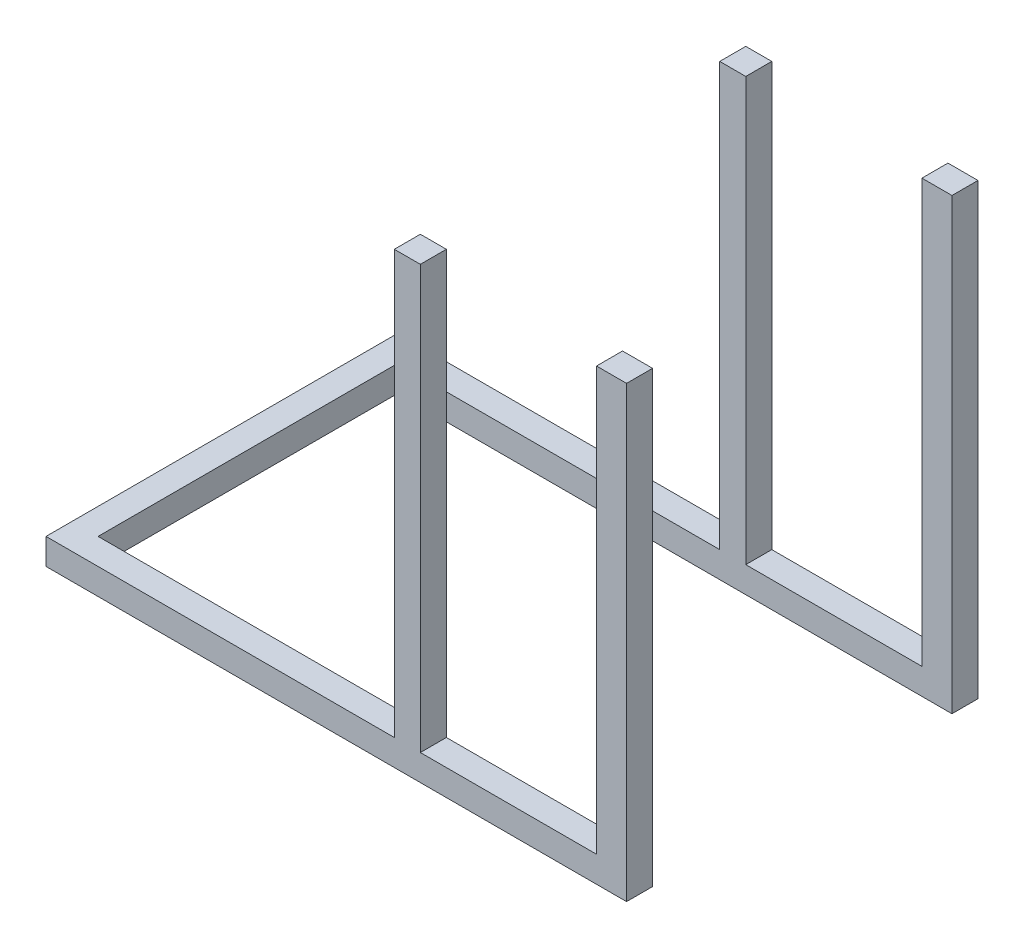
ISO-10303-21;
HEADER;
FILE_DESCRIPTION(('STEP AP214'),'2;1');
FILE_NAME('part.step','',(''),(''),'','','');
FILE_SCHEMA(('AUTOMOTIVE_DESIGN { 1 0 10303 214 1 1 1 1 }'));
ENDSEC;
DATA;
#1=APPLICATION_CONTEXT('core data for automotive mechanical design processes');
#2=APPLICATION_PROTOCOL_DEFINITION('international standard','automotive_design',2000,#1);
#3=PRODUCT_CONTEXT('',#1,'mechanical');
#4=PRODUCT('Part','Part','',(#3));
#5=PRODUCT_RELATED_PRODUCT_CATEGORY('part','',(#4));
#6=PRODUCT_DEFINITION_FORMATION('','',#4);
#7=PRODUCT_DEFINITION_CONTEXT('part definition',#1,'design');
#8=PRODUCT_DEFINITION('design','',#6,#7);
#9=PRODUCT_DEFINITION_SHAPE('','',#8);
#10=(LENGTH_UNIT() NAMED_UNIT(*) SI_UNIT(.MILLI.,.METRE.));
#11=(NAMED_UNIT(*) PLANE_ANGLE_UNIT() SI_UNIT($,.RADIAN.));
#12=(NAMED_UNIT(*) SI_UNIT($,.STERADIAN.) SOLID_ANGLE_UNIT());
#13=UNCERTAINTY_MEASURE_WITH_UNIT(LENGTH_MEASURE(1.E-05),#10,'distance_accuracy_value','');
#14=(GEOMETRIC_REPRESENTATION_CONTEXT(3) GLOBAL_UNCERTAINTY_ASSIGNED_CONTEXT((#13)) GLOBAL_UNIT_ASSIGNED_CONTEXT((#10,
#11,#12)) REPRESENTATION_CONTEXT('',''));
#15=CARTESIAN_POINT('',(0.,0.,0.));
#16=DIRECTION('',(0.,0.,1.));
#17=DIRECTION('',(1.,0.,0.));
#18=AXIS2_PLACEMENT_3D('',#15,#16,#17);
#19=CARTESIAN_POINT('',(0.,58.,0.));
#20=DIRECTION('',(0.,1.,0.));
#21=DIRECTION('',(0.,0.,1.));
#22=AXIS2_PLACEMENT_3D('',#19,#20,#21);
#23=PLANE('',#22);
#24=DIRECTION('',(1.,0.,0.));
#25=VECTOR('',#24,1.);
#26=CARTESIAN_POINT('',(-435.,58.,391.5));
#27=LINE('',#26,#25);
#28=CARTESIAN_POINT('',(-435.,58.,391.5));
#29=VERTEX_POINT('',#28);
#30=CARTESIAN_POINT('',(341.,58.,391.5));
#31=VERTEX_POINT('',#30);
#32=EDGE_CURVE('E56',#29,#31,#27,.T.);
#33=ORIENTED_EDGE('',*,*,#32,.T.);
#34=DIRECTION('',(0.,0.,-1.));
#35=VECTOR('',#34,1.);
#36=CARTESIAN_POINT('',(341.,58.,0.));
#37=LINE('',#36,#35);
#38=CARTESIAN_POINT('',(341.,58.,333.5));
#39=VERTEX_POINT('',#38);
#40=EDGE_CURVE('E192',#31,#39,#37,.T.);
#41=ORIENTED_EDGE('',*,*,#40,.T.);
#42=DIRECTION('',(-1.,0.,0.));
#43=VECTOR('',#42,1.);
#44=CARTESIAN_POINT('',(-377.,58.,333.5));
#45=LINE('',#44,#43);
#46=CARTESIAN_POINT('',(-377.,58.,333.5));
#47=VERTEX_POINT('',#46);
#48=EDGE_CURVE('E268',#39,#47,#45,.T.);
#49=ORIENTED_EDGE('',*,*,#48,.T.);
#50=DIRECTION('',(0.,0.,-1.));
#51=VECTOR('',#50,1.);
#52=CARTESIAN_POINT('',(-377.,58.,-333.5));
#53=LINE('',#52,#51);
#54=CARTESIAN_POINT('',(-377.,58.,-333.5));
#55=VERTEX_POINT('',#54);
#56=EDGE_CURVE('E271',#47,#55,#53,.T.);
#57=ORIENTED_EDGE('',*,*,#56,.T.);
#58=DIRECTION('',(1.,0.,0.));
#59=VECTOR('',#58,1.);
#60=CARTESIAN_POINT('',(-377.,58.,-333.5));
#61=LINE('',#60,#59);
#62=CARTESIAN_POINT('',(341.,58.,-333.5));
#63=VERTEX_POINT('',#62);
#64=EDGE_CURVE('E274',#55,#63,#61,.T.);
#65=ORIENTED_EDGE('',*,*,#64,.T.);
#66=DIRECTION('',(0.,0.,-1.));
#67=VECTOR('',#66,1.);
#68=CARTESIAN_POINT('',(341.,58.,0.));
#69=LINE('',#68,#67);
#70=CARTESIAN_POINT('',(341.,58.,-391.5));
#71=VERTEX_POINT('',#70);
#72=EDGE_CURVE('E257',#63,#71,#69,.T.);
#73=ORIENTED_EDGE('',*,*,#72,.T.);
#74=DIRECTION('',(-1.,0.,0.));
#75=VECTOR('',#74,1.);
#76=CARTESIAN_POINT('',(-435.,58.,-391.5));
#77=LINE('',#76,#75);
#78=CARTESIAN_POINT('',(-435.,58.,-391.5));
#79=VERTEX_POINT('',#78);
#80=EDGE_CURVE('E276',#71,#79,#77,.T.);
#81=ORIENTED_EDGE('',*,*,#80,.T.);
#82=DIRECTION('',(0.,0.,1.));
#83=VECTOR('',#82,1.);
#84=CARTESIAN_POINT('',(-435.,58.,-391.5));
#85=LINE('',#84,#83);
#86=EDGE_CURVE('E263',#79,#29,#85,.T.);
#87=ORIENTED_EDGE('',*,*,#86,.T.);
#88=EDGE_LOOP('',(#33,#41,#49,#57,#65,#73,#81,#87));
#89=FACE_BOUND('',#88,.T.);
#90=ADVANCED_FACE('F33',(#89),#23,.T.);
#91=CARTESIAN_POINT('',(791.45225187829,58.,333.5));
#92=VERTEX_POINT('',#91);
#93=CARTESIAN_POINT('',(399.,58.,333.5));
#94=VERTEX_POINT('',#93);
#95=EDGE_CURVE('E269',#92,#94,#45,.T.);
#96=ORIENTED_EDGE('',*,*,#95,.T.);
#97=DIRECTION('',(0.,0.,1.));
#98=VECTOR('',#97,1.);
#99=CARTESIAN_POINT('',(399.,58.,0.));
#100=LINE('',#99,#98);
#101=CARTESIAN_POINT('',(399.,58.,391.5));
#102=VERTEX_POINT('',#101);
#103=EDGE_CURVE('E48',#94,#102,#100,.T.);
#104=ORIENTED_EDGE('',*,*,#103,.T.);
#105=CARTESIAN_POINT('',(791.45225187829,58.,391.5));
#106=VERTEX_POINT('',#105);
#107=EDGE_CURVE('E265',#102,#106,#27,.T.);
#108=ORIENTED_EDGE('',*,*,#107,.T.);
#109=DIRECTION('',(0.,0.,-1.));
#110=VECTOR('',#109,1.);
#111=CARTESIAN_POINT('',(791.45225187829,58.,0.));
#112=LINE('',#111,#110);
#113=EDGE_CURVE('E216',#106,#92,#112,.T.);
#114=ORIENTED_EDGE('',*,*,#113,.T.);
#115=EDGE_LOOP('',(#96,#104,#108,#114));
#116=FACE_BOUND('',#115,.T.);
#117=ADVANCED_FACE('F350',(#116),#23,.T.);
#118=CARTESIAN_POINT('',(399.,58.,-333.5));
#119=VERTEX_POINT('',#118);
#120=CARTESIAN_POINT('',(791.45225187829,58.,-333.5));
#121=VERTEX_POINT('',#120);
#122=EDGE_CURVE('E273',#119,#121,#61,.T.);
#123=ORIENTED_EDGE('',*,*,#122,.T.);
#124=DIRECTION('',(0.,0.,-1.));
#125=VECTOR('',#124,1.);
#126=CARTESIAN_POINT('',(791.45225187829,58.,0.));
#127=LINE('',#126,#125);
#128=CARTESIAN_POINT('',(791.45225187829,58.,-391.5));
#129=VERTEX_POINT('',#128);
#130=EDGE_CURVE('E234',#121,#129,#127,.T.);
#131=ORIENTED_EDGE('',*,*,#130,.T.);
#132=CARTESIAN_POINT('',(399.,58.,-391.5));
#133=VERTEX_POINT('',#132);
#134=EDGE_CURVE('E277',#129,#133,#77,.T.);
#135=ORIENTED_EDGE('',*,*,#134,.T.);
#136=DIRECTION('',(0.,0.,1.));
#137=VECTOR('',#136,1.);
#138=CARTESIAN_POINT('',(399.,58.,3.8187843691848E-13));
#139=LINE('',#138,#137);
#140=EDGE_CURVE('E259',#133,#119,#139,.T.);
#141=ORIENTED_EDGE('',*,*,#140,.T.);
#142=EDGE_LOOP('',(#123,#131,#135,#141));
#143=FACE_BOUND('',#142,.T.);
#144=ADVANCED_FACE('F352',(#143),#23,.T.);
#145=CARTESIAN_POINT('',(-435.,58.,-391.5));
#146=DIRECTION('',(1.,0.,0.));
#147=DIRECTION('',(0.,0.,-1.));
#148=AXIS2_PLACEMENT_3D('',#145,#146,#147);
#149=PLANE('',#148);
#150=DIRECTION('',(0.,0.,1.));
#151=VECTOR('',#150,1.);
#152=CARTESIAN_POINT('',(-435.,0.,-391.5));
#153=LINE('',#152,#151);
#154=CARTESIAN_POINT('',(-435.,0.,-391.5));
#155=VERTEX_POINT('',#154);
#156=CARTESIAN_POINT('',(-435.,0.,391.5));
#157=VERTEX_POINT('',#156);
#158=EDGE_CURVE('E262',#155,#157,#153,.T.);
#159=ORIENTED_EDGE('',*,*,#158,.T.);
#160=DIRECTION('',(0.,-1.,0.));
#161=VECTOR('',#160,1.);
#162=CARTESIAN_POINT('',(-435.,58.,391.5));
#163=LINE('',#162,#161);
#164=EDGE_CURVE('E11',#29,#157,#163,.T.);
#165=ORIENTED_EDGE('',*,*,#164,.F.);
#166=ORIENTED_EDGE('',*,*,#86,.F.);
#167=DIRECTION('',(0.,-1.,0.));
#168=VECTOR('',#167,1.);
#169=CARTESIAN_POINT('',(-435.,58.,-391.5));
#170=LINE('',#169,#168);
#171=EDGE_CURVE('E279',#79,#155,#170,.T.);
#172=ORIENTED_EDGE('',*,*,#171,.T.);
#173=EDGE_LOOP('',(#159,#165,#166,#172));
#174=FACE_BOUND('',#173,.T.);
#175=ADVANCED_FACE('F35',(#174),#149,.F.);
#176=CARTESIAN_POINT('',(-435.,58.,391.5));
#177=DIRECTION('',(0.,0.,-1.));
#178=DIRECTION('',(-1.,0.,0.));
#179=AXIS2_PLACEMENT_3D('',#176,#177,#178);
#180=PLANE('',#179);
#181=ORIENTED_EDGE('',*,*,#107,.F.);
#182=DIRECTION('',(0.,-1.,0.));
#183=VECTOR('',#182,1.);
#184=CARTESIAN_POINT('',(399.,1000.,391.5));
#185=LINE('',#184,#183);
#186=CARTESIAN_POINT('',(399.,1000.,391.5));
#187=VERTEX_POINT('',#186);
#188=EDGE_CURVE('E177',#187,#102,#185,.T.);
#189=ORIENTED_EDGE('',*,*,#188,.F.);
#190=DIRECTION('',(1.,0.,0.));
#191=VECTOR('',#190,1.);
#192=CARTESIAN_POINT('',(341.,1000.,391.5));
#193=LINE('',#192,#191);
#194=CARTESIAN_POINT('',(341.,1000.,391.5));
#195=VERTEX_POINT('',#194);
#196=EDGE_CURVE('E171',#195,#187,#193,.T.);
#197=ORIENTED_EDGE('',*,*,#196,.F.);
#198=DIRECTION('',(0.,-1.,0.));
#199=VECTOR('',#198,1.);
#200=CARTESIAN_POINT('',(341.,1000.,391.5));
#201=LINE('',#200,#199);
#202=EDGE_CURVE('E175',#195,#31,#201,.T.);
#203=ORIENTED_EDGE('',*,*,#202,.T.);
#204=ORIENTED_EDGE('',*,*,#32,.F.);
#205=ORIENTED_EDGE('',*,*,#164,.T.);
#206=DIRECTION('',(1.,0.,0.));
#207=VECTOR('',#206,1.);
#208=CARTESIAN_POINT('',(-435.,0.,391.5));
#209=LINE('',#208,#207);
#210=CARTESIAN_POINT('',(858.400000000001,0.,391.5));
#211=VERTEX_POINT('',#210);
#212=EDGE_CURVE('E282',#157,#211,#209,.T.);
#213=ORIENTED_EDGE('',*,*,#212,.T.);
#214=DIRECTION('',(0.,-1.,0.));
#215=VECTOR('',#214,1.);
#216=CARTESIAN_POINT('',(858.400000000001,58.,391.5));
#217=LINE('',#216,#215);
#218=CARTESIAN_POINT('',(858.4,1000.,391.5));
#219=VERTEX_POINT('',#218);
#220=EDGE_CURVE('E41',#219,#211,#217,.T.);
#221=ORIENTED_EDGE('',*,*,#220,.F.);
#222=DIRECTION('',(1.,0.,0.));
#223=VECTOR('',#222,1.);
#224=CARTESIAN_POINT('',(858.4,1000.,391.5));
#225=LINE('',#224,#223);
#226=CARTESIAN_POINT('',(791.45225187829,1000.,391.5));
#227=VERTEX_POINT('',#226);
#228=EDGE_CURVE('E207',#227,#219,#225,.T.);
#229=ORIENTED_EDGE('',*,*,#228,.F.);
#230=DIRECTION('',(0.,-1.,0.));
#231=VECTOR('',#230,1.);
#232=CARTESIAN_POINT('',(791.45225187829,1000.,391.5));
#233=LINE('',#232,#231);
#234=EDGE_CURVE('E210',#227,#106,#233,.T.);
#235=ORIENTED_EDGE('',*,*,#234,.T.);
#236=EDGE_LOOP('',(#181,#189,#197,#203,#204,#205,#213,#221,#229,#235));
#237=FACE_BOUND('',#236,.T.);
#238=ADVANCED_FACE('F173',(#237),#180,.F.);
#239=CARTESIAN_POINT('',(858.4,58.,333.5));
#240=DIRECTION('',(-1.,0.,0.));
#241=DIRECTION('',(0.,0.,1.));
#242=AXIS2_PLACEMENT_3D('',#239,#240,#241);
#243=PLANE('',#242);
#244=DIRECTION('',(0.,0.,-1.));
#245=VECTOR('',#244,1.);
#246=CARTESIAN_POINT('',(858.4,0.,333.5));
#247=LINE('',#246,#245);
#248=CARTESIAN_POINT('',(858.4,0.,333.5));
#249=VERTEX_POINT('',#248);
#250=EDGE_CURVE('E284',#211,#249,#247,.T.);
#251=ORIENTED_EDGE('',*,*,#250,.T.);
#252=DIRECTION('',(0.,-1.,0.));
#253=VECTOR('',#252,1.);
#254=CARTESIAN_POINT('',(858.4,58.,333.5));
#255=LINE('',#254,#253);
#256=CARTESIAN_POINT('',(858.4,1000.,333.5));
#257=VERTEX_POINT('',#256);
#258=EDGE_CURVE('E309',#257,#249,#255,.T.);
#259=ORIENTED_EDGE('',*,*,#258,.F.);
#260=DIRECTION('',(0.,0.,-1.));
#261=VECTOR('',#260,1.);
#262=CARTESIAN_POINT('',(858.4,1000.,333.5));
#263=LINE('',#262,#261);
#264=EDGE_CURVE('E200',#219,#257,#263,.T.);
#265=ORIENTED_EDGE('',*,*,#264,.F.);
#266=ORIENTED_EDGE('',*,*,#220,.T.);
#267=EDGE_LOOP('',(#251,#259,#265,#266));
#268=FACE_BOUND('',#267,.T.);
#269=ADVANCED_FACE('F315',(#268),#243,.F.);
#270=CARTESIAN_POINT('',(-377.,58.,333.5));
#271=DIRECTION('',(0.,0.,1.));
#272=DIRECTION('',(1.,0.,0.));
#273=AXIS2_PLACEMENT_3D('',#270,#271,#272);
#274=PLANE('',#273);
#275=DIRECTION('',(-1.,0.,0.));
#276=VECTOR('',#275,1.);
#277=CARTESIAN_POINT('',(-377.,0.,333.5));
#278=LINE('',#277,#276);
#279=CARTESIAN_POINT('',(-377.,0.,333.5));
#280=VERTEX_POINT('',#279);
#281=EDGE_CURVE('E286',#249,#280,#278,.T.);
#282=ORIENTED_EDGE('',*,*,#281,.T.);
#283=DIRECTION('',(0.,-1.,0.));
#284=VECTOR('',#283,1.);
#285=CARTESIAN_POINT('',(-377.,58.,333.5));
#286=LINE('',#285,#284);
#287=EDGE_CURVE('E306',#47,#280,#286,.T.);
#288=ORIENTED_EDGE('',*,*,#287,.F.);
#289=ORIENTED_EDGE('',*,*,#48,.F.);
#290=DIRECTION('',(0.,-1.,0.));
#291=VECTOR('',#290,1.);
#292=CARTESIAN_POINT('',(341.,1000.,333.5));
#293=LINE('',#292,#291);
#294=CARTESIAN_POINT('',(341.,1000.,333.5));
#295=VERTEX_POINT('',#294);
#296=EDGE_CURVE('E333',#295,#39,#293,.T.);
#297=ORIENTED_EDGE('',*,*,#296,.F.);
#298=DIRECTION('',(-1.,0.,0.));
#299=VECTOR('',#298,1.);
#300=CARTESIAN_POINT('',(341.,1000.,333.5));
#301=LINE('',#300,#299);
#302=CARTESIAN_POINT('',(399.,1000.,333.5));
#303=VERTEX_POINT('',#302);
#304=EDGE_CURVE('E186',#303,#295,#301,.T.);
#305=ORIENTED_EDGE('',*,*,#304,.F.);
#306=DIRECTION('',(0.,-1.,0.));
#307=VECTOR('',#306,1.);
#308=CARTESIAN_POINT('',(399.,1000.,333.5));
#309=LINE('',#308,#307);
#310=EDGE_CURVE('E195',#303,#94,#309,.T.);
#311=ORIENTED_EDGE('',*,*,#310,.T.);
#312=ORIENTED_EDGE('',*,*,#95,.F.);
#313=DIRECTION('',(0.,-1.,0.));
#314=VECTOR('',#313,1.);
#315=CARTESIAN_POINT('',(791.45225187829,1000.,333.5));
#316=LINE('',#315,#314);
#317=CARTESIAN_POINT('',(791.45225187829,1000.,333.5));
#318=VERTEX_POINT('',#317);
#319=EDGE_CURVE('E213',#318,#92,#316,.T.);
#320=ORIENTED_EDGE('',*,*,#319,.F.);
#321=DIRECTION('',(-1.,0.,0.));
#322=VECTOR('',#321,1.);
#323=CARTESIAN_POINT('',(858.4,1000.,333.5));
#324=LINE('',#323,#322);
#325=EDGE_CURVE('E203',#257,#318,#324,.T.);
#326=ORIENTED_EDGE('',*,*,#325,.F.);
#327=ORIENTED_EDGE('',*,*,#258,.T.);
#328=EDGE_LOOP('',(#282,#288,#289,#297,#305,#311,#312,#320,#326,#327));
#329=FACE_BOUND('',#328,.T.);
#330=ADVANCED_FACE('F325',(#329),#274,.F.);
#331=CARTESIAN_POINT('',(-377.,58.,-333.5));
#332=DIRECTION('',(-1.,0.,0.));
#333=DIRECTION('',(0.,0.,1.));
#334=AXIS2_PLACEMENT_3D('',#331,#332,#333);
#335=PLANE('',#334);
#336=DIRECTION('',(0.,0.,-1.));
#337=VECTOR('',#336,1.);
#338=CARTESIAN_POINT('',(-377.,0.,-333.5));
#339=LINE('',#338,#337);
#340=CARTESIAN_POINT('',(-377.,0.,-333.5));
#341=VERTEX_POINT('',#340);
#342=EDGE_CURVE('E288',#280,#341,#339,.T.);
#343=ORIENTED_EDGE('',*,*,#342,.T.);
#344=DIRECTION('',(0.,-1.,0.));
#345=VECTOR('',#344,1.);
#346=CARTESIAN_POINT('',(-377.,58.,-333.5));
#347=LINE('',#346,#345);
#348=EDGE_CURVE('E303',#55,#341,#347,.T.);
#349=ORIENTED_EDGE('',*,*,#348,.F.);
#350=ORIENTED_EDGE('',*,*,#56,.F.);
#351=ORIENTED_EDGE('',*,*,#287,.T.);
#352=EDGE_LOOP('',(#343,#349,#350,#351));
#353=FACE_BOUND('',#352,.T.);
#354=ADVANCED_FACE('F329',(#353),#335,.F.);
#355=CARTESIAN_POINT('',(-377.,58.,-333.5));
#356=DIRECTION('',(0.,0.,-1.));
#357=DIRECTION('',(-1.,0.,0.));
#358=AXIS2_PLACEMENT_3D('',#355,#356,#357);
#359=PLANE('',#358);
#360=DIRECTION('',(0.,-1.,0.));
#361=VECTOR('',#360,1.);
#362=CARTESIAN_POINT('',(858.4,58.,-333.5));
#363=LINE('',#362,#361);
#364=CARTESIAN_POINT('',(858.4,1000.,-333.5));
#365=VERTEX_POINT('',#364);
#366=CARTESIAN_POINT('',(858.4,0.,-333.5));
#367=VERTEX_POINT('',#366);
#368=EDGE_CURVE('E300',#365,#367,#363,.T.);
#369=ORIENTED_EDGE('',*,*,#368,.F.);
#370=DIRECTION('',(1.,0.,0.));
#371=VECTOR('',#370,1.);
#372=CARTESIAN_POINT('',(858.4,1000.,-333.5));
#373=LINE('',#372,#371);
#374=CARTESIAN_POINT('',(791.45225187829,1000.,-333.5));
#375=VERTEX_POINT('',#374);
#376=EDGE_CURVE('E225',#375,#365,#373,.T.);
#377=ORIENTED_EDGE('',*,*,#376,.F.);
#378=DIRECTION('',(0.,-1.,0.));
#379=VECTOR('',#378,1.);
#380=CARTESIAN_POINT('',(791.45225187829,1000.,-333.5));
#381=LINE('',#380,#379);
#382=EDGE_CURVE('E228',#375,#121,#381,.T.);
#383=ORIENTED_EDGE('',*,*,#382,.T.);
#384=ORIENTED_EDGE('',*,*,#122,.F.);
#385=DIRECTION('',(0.,-1.,0.));
#386=VECTOR('',#385,1.);
#387=CARTESIAN_POINT('',(399.,1000.,-333.5));
#388=LINE('',#387,#386);
#389=CARTESIAN_POINT('',(399.,1000.,-333.5));
#390=VERTEX_POINT('',#389);
#391=EDGE_CURVE('E245',#390,#119,#388,.T.);
#392=ORIENTED_EDGE('',*,*,#391,.F.);
#393=DIRECTION('',(1.,0.,0.));
#394=VECTOR('',#393,1.);
#395=CARTESIAN_POINT('',(399.,1000.,-333.5));
#396=LINE('',#395,#394);
#397=CARTESIAN_POINT('',(341.,1000.,-333.5));
#398=VERTEX_POINT('',#397);
#399=EDGE_CURVE('E243',#398,#390,#396,.T.);
#400=ORIENTED_EDGE('',*,*,#399,.F.);
#401=DIRECTION('',(0.,-1.,0.));
#402=VECTOR('',#401,1.);
#403=CARTESIAN_POINT('',(341.,1000.,-333.5));
#404=LINE('',#403,#402);
#405=EDGE_CURVE('E248',#398,#63,#404,.T.);
#406=ORIENTED_EDGE('',*,*,#405,.T.);
#407=ORIENTED_EDGE('',*,*,#64,.F.);
#408=ORIENTED_EDGE('',*,*,#348,.T.);
#409=DIRECTION('',(1.,0.,0.));
#410=VECTOR('',#409,1.);
#411=CARTESIAN_POINT('',(-377.,0.,-333.5));
#412=LINE('',#411,#410);
#413=EDGE_CURVE('E290',#341,#367,#412,.T.);
#414=ORIENTED_EDGE('',*,*,#413,.T.);
#415=EDGE_LOOP('',(#369,#377,#383,#384,#392,#400,#406,#407,#408,#414));
#416=FACE_BOUND('',#415,.T.);
#417=ADVANCED_FACE('F372',(#416),#359,.F.);
#418=CARTESIAN_POINT('',(858.4,58.,-391.5));
#419=DIRECTION('',(-1.,0.,0.));
#420=DIRECTION('',(0.,0.,1.));
#421=AXIS2_PLACEMENT_3D('',#418,#419,#420);
#422=PLANE('',#421);
#423=DIRECTION('',(0.,0.,-1.));
#424=VECTOR('',#423,1.);
#425=CARTESIAN_POINT('',(858.4,0.,-391.5));
#426=LINE('',#425,#424);
#427=CARTESIAN_POINT('',(858.4,0.,-391.5));
#428=VERTEX_POINT('',#427);
#429=EDGE_CURVE('E292',#367,#428,#426,.T.);
#430=ORIENTED_EDGE('',*,*,#429,.T.);
#431=DIRECTION('',(0.,-1.,0.));
#432=VECTOR('',#431,1.);
#433=CARTESIAN_POINT('',(858.4,58.,-391.5));
#434=LINE('',#433,#432);
#435=CARTESIAN_POINT('',(858.4,1000.,-391.5));
#436=VERTEX_POINT('',#435);
#437=EDGE_CURVE('E297',#436,#428,#434,.T.);
#438=ORIENTED_EDGE('',*,*,#437,.F.);
#439=DIRECTION('',(0.,0.,-1.));
#440=VECTOR('',#439,1.);
#441=CARTESIAN_POINT('',(858.4,1000.,-391.5));
#442=LINE('',#441,#440);
#443=EDGE_CURVE('E218',#365,#436,#442,.T.);
#444=ORIENTED_EDGE('',*,*,#443,.F.);
#445=ORIENTED_EDGE('',*,*,#368,.T.);
#446=EDGE_LOOP('',(#430,#438,#444,#445));
#447=FACE_BOUND('',#446,.T.);
#448=ADVANCED_FACE('F368',(#447),#422,.F.);
#449=CARTESIAN_POINT('',(-435.,58.,-391.5));
#450=DIRECTION('',(0.,0.,1.));
#451=DIRECTION('',(1.,0.,0.));
#452=AXIS2_PLACEMENT_3D('',#449,#450,#451);
#453=PLANE('',#452);
#454=DIRECTION('',(-1.,0.,0.));
#455=VECTOR('',#454,1.);
#456=CARTESIAN_POINT('',(-435.,0.,-391.5));
#457=LINE('',#456,#455);
#458=EDGE_CURVE('E266',#428,#155,#457,.T.);
#459=ORIENTED_EDGE('',*,*,#458,.T.);
#460=ORIENTED_EDGE('',*,*,#171,.F.);
#461=ORIENTED_EDGE('',*,*,#80,.F.);
#462=DIRECTION('',(0.,-1.,0.));
#463=VECTOR('',#462,1.);
#464=CARTESIAN_POINT('',(341.,1000.,-391.5));
#465=LINE('',#464,#463);
#466=CARTESIAN_POINT('',(341.,1000.,-391.5));
#467=VERTEX_POINT('',#466);
#468=EDGE_CURVE('E251',#467,#71,#465,.T.);
#469=ORIENTED_EDGE('',*,*,#468,.F.);
#470=DIRECTION('',(-1.,0.,0.));
#471=VECTOR('',#470,1.);
#472=CARTESIAN_POINT('',(399.,1000.,-391.5));
#473=LINE('',#472,#471);
#474=CARTESIAN_POINT('',(399.,1000.,-391.5));
#475=VERTEX_POINT('',#474);
#476=EDGE_CURVE('E239',#475,#467,#473,.T.);
#477=ORIENTED_EDGE('',*,*,#476,.F.);
#478=DIRECTION('',(0.,-1.,0.));
#479=VECTOR('',#478,1.);
#480=CARTESIAN_POINT('',(399.,1000.,-391.5));
#481=LINE('',#480,#479);
#482=EDGE_CURVE('E254',#475,#133,#481,.T.);
#483=ORIENTED_EDGE('',*,*,#482,.T.);
#484=ORIENTED_EDGE('',*,*,#134,.F.);
#485=DIRECTION('',(0.,-1.,0.));
#486=VECTOR('',#485,1.);
#487=CARTESIAN_POINT('',(791.45225187829,1000.,-391.5));
#488=LINE('',#487,#486);
#489=CARTESIAN_POINT('',(791.45225187829,1000.,-391.5));
#490=VERTEX_POINT('',#489);
#491=EDGE_CURVE('E231',#490,#129,#488,.T.);
#492=ORIENTED_EDGE('',*,*,#491,.F.);
#493=DIRECTION('',(-1.,0.,0.));
#494=VECTOR('',#493,1.);
#495=CARTESIAN_POINT('',(858.4,1000.,-391.5));
#496=LINE('',#495,#494);
#497=EDGE_CURVE('E221',#436,#490,#496,.T.);
#498=ORIENTED_EDGE('',*,*,#497,.F.);
#499=ORIENTED_EDGE('',*,*,#437,.T.);
#500=EDGE_LOOP('',(#459,#460,#461,#469,#477,#483,#484,#492,#498,#499));
#501=FACE_BOUND('',#500,.T.);
#502=ADVANCED_FACE('F365',(#501),#453,.F.);
#503=CARTESIAN_POINT('',(0.,0.,0.));
#504=DIRECTION('',(0.,1.,0.));
#505=DIRECTION('',(0.,0.,1.));
#506=AXIS2_PLACEMENT_3D('',#503,#504,#505);
#507=PLANE('',#506);
#508=ORIENTED_EDGE('',*,*,#250,.F.);
#509=ORIENTED_EDGE('',*,*,#212,.F.);
#510=ORIENTED_EDGE('',*,*,#158,.F.);
#511=ORIENTED_EDGE('',*,*,#458,.F.);
#512=ORIENTED_EDGE('',*,*,#429,.F.);
#513=ORIENTED_EDGE('',*,*,#413,.F.);
#514=ORIENTED_EDGE('',*,*,#342,.F.);
#515=ORIENTED_EDGE('',*,*,#281,.F.);
#516=EDGE_LOOP('',(#508,#509,#510,#511,#512,#513,#514,#515));
#517=FACE_BOUND('',#516,.T.);
#518=ADVANCED_FACE('F319',(#517),#507,.F.);
#519=CARTESIAN_POINT('',(399.,1000.,-391.5));
#520=DIRECTION('',(-1.,0.,0.));
#521=DIRECTION('',(0.,0.,1.));
#522=AXIS2_PLACEMENT_3D('',#519,#520,#521);
#523=PLANE('',#522);
#524=ORIENTED_EDGE('',*,*,#140,.F.);
#525=ORIENTED_EDGE('',*,*,#482,.F.);
#526=DIRECTION('',(0.,0.,-1.));
#527=VECTOR('',#526,1.);
#528=CARTESIAN_POINT('',(399.,1000.,-391.5));
#529=LINE('',#528,#527);
#530=EDGE_CURVE('E236',#390,#475,#529,.T.);
#531=ORIENTED_EDGE('',*,*,#530,.F.);
#532=ORIENTED_EDGE('',*,*,#391,.T.);
#533=EDGE_LOOP('',(#524,#525,#531,#532));
#534=FACE_BOUND('',#533,.T.);
#535=ADVANCED_FACE('F361',(#534),#523,.F.);
#536=CARTESIAN_POINT('',(341.,1000.,-391.5));
#537=DIRECTION('',(1.,0.,0.));
#538=DIRECTION('',(0.,0.,-1.));
#539=AXIS2_PLACEMENT_3D('',#536,#537,#538);
#540=PLANE('',#539);
#541=ORIENTED_EDGE('',*,*,#72,.F.);
#542=ORIENTED_EDGE('',*,*,#405,.F.);
#543=DIRECTION('',(0.,0.,1.));
#544=VECTOR('',#543,1.);
#545=CARTESIAN_POINT('',(341.,1000.,-391.5));
#546=LINE('',#545,#544);
#547=EDGE_CURVE('E241',#467,#398,#546,.T.);
#548=ORIENTED_EDGE('',*,*,#547,.F.);
#549=ORIENTED_EDGE('',*,*,#468,.T.);
#550=EDGE_LOOP('',(#541,#542,#548,#549));
#551=FACE_BOUND('',#550,.T.);
#552=ADVANCED_FACE('F419',(#551),#540,.F.);
#553=CARTESIAN_POINT('',(0.,1000.,0.));
#554=DIRECTION('',(0.,-1.,0.));
#555=DIRECTION('',(0.,0.,-1.));
#556=AXIS2_PLACEMENT_3D('',#553,#554,#555);
#557=PLANE('',#556);
#558=ORIENTED_EDGE('',*,*,#530,.T.);
#559=ORIENTED_EDGE('',*,*,#476,.T.);
#560=ORIENTED_EDGE('',*,*,#547,.T.);
#561=ORIENTED_EDGE('',*,*,#399,.T.);
#562=EDGE_LOOP('',(#558,#559,#560,#561));
#563=FACE_BOUND('',#562,.T.);
#564=ADVANCED_FACE('F414',(#563),#557,.F.);
#565=CARTESIAN_POINT('',(791.45225187829,1000.,-391.5));
#566=DIRECTION('',(1.,0.,0.));
#567=DIRECTION('',(0.,0.,-1.));
#568=AXIS2_PLACEMENT_3D('',#565,#566,#567);
#569=PLANE('',#568);
#570=ORIENTED_EDGE('',*,*,#130,.F.);
#571=ORIENTED_EDGE('',*,*,#382,.F.);
#572=DIRECTION('',(0.,0.,1.));
#573=VECTOR('',#572,1.);
#574=CARTESIAN_POINT('',(791.45225187829,1000.,-391.5));
#575=LINE('',#574,#573);
#576=EDGE_CURVE('E223',#490,#375,#575,.T.);
#577=ORIENTED_EDGE('',*,*,#576,.F.);
#578=ORIENTED_EDGE('',*,*,#491,.T.);
#579=EDGE_LOOP('',(#570,#571,#577,#578));
#580=FACE_BOUND('',#579,.T.);
#581=ADVANCED_FACE('F405',(#580),#569,.F.);
#582=CARTESIAN_POINT('',(0.,1000.,0.));
#583=DIRECTION('',(0.,-1.,0.));
#584=DIRECTION('',(0.,0.,-1.));
#585=AXIS2_PLACEMENT_3D('',#582,#583,#584);
#586=PLANE('',#585);
#587=ORIENTED_EDGE('',*,*,#443,.T.);
#588=ORIENTED_EDGE('',*,*,#497,.T.);
#589=ORIENTED_EDGE('',*,*,#576,.T.);
#590=ORIENTED_EDGE('',*,*,#376,.T.);
#591=EDGE_LOOP('',(#587,#588,#589,#590));
#592=FACE_BOUND('',#591,.T.);
#593=ADVANCED_FACE('F400',(#592),#586,.F.);
#594=CARTESIAN_POINT('',(791.45225187829,1000.,333.5));
#595=DIRECTION('',(1.,0.,0.));
#596=DIRECTION('',(0.,0.,-1.));
#597=AXIS2_PLACEMENT_3D('',#594,#595,#596);
#598=PLANE('',#597);
#599=ORIENTED_EDGE('',*,*,#113,.F.);
#600=ORIENTED_EDGE('',*,*,#234,.F.);
#601=DIRECTION('',(0.,0.,1.));
#602=VECTOR('',#601,1.);
#603=CARTESIAN_POINT('',(791.45225187829,1000.,333.5));
#604=LINE('',#603,#602);
#605=EDGE_CURVE('E205',#318,#227,#604,.T.);
#606=ORIENTED_EDGE('',*,*,#605,.F.);
#607=ORIENTED_EDGE('',*,*,#319,.T.);
#608=EDGE_LOOP('',(#599,#600,#606,#607));
#609=FACE_BOUND('',#608,.T.);
#610=ADVANCED_FACE('F346',(#609),#598,.F.);
#611=CARTESIAN_POINT('',(0.,1000.,0.));
#612=DIRECTION('',(0.,-1.,0.));
#613=DIRECTION('',(0.,0.,-1.));
#614=AXIS2_PLACEMENT_3D('',#611,#612,#613);
#615=PLANE('',#614);
#616=ORIENTED_EDGE('',*,*,#264,.T.);
#617=ORIENTED_EDGE('',*,*,#325,.T.);
#618=ORIENTED_EDGE('',*,*,#605,.T.);
#619=ORIENTED_EDGE('',*,*,#228,.T.);
#620=EDGE_LOOP('',(#616,#617,#618,#619));
#621=FACE_BOUND('',#620,.T.);
#622=ADVANCED_FACE('F349',(#621),#615,.F.);
#623=CARTESIAN_POINT('',(341.,1000.,333.5));
#624=DIRECTION('',(1.,0.,0.));
#625=DIRECTION('',(0.,0.,-1.));
#626=AXIS2_PLACEMENT_3D('',#623,#624,#625);
#627=PLANE('',#626);
#628=ORIENTED_EDGE('',*,*,#40,.F.);
#629=ORIENTED_EDGE('',*,*,#202,.F.);
#630=DIRECTION('',(0.,0.,1.));
#631=VECTOR('',#630,1.);
#632=CARTESIAN_POINT('',(341.,1000.,333.5));
#633=LINE('',#632,#631);
#634=EDGE_CURVE('E181',#295,#195,#633,.T.);
#635=ORIENTED_EDGE('',*,*,#634,.F.);
#636=ORIENTED_EDGE('',*,*,#296,.T.);
#637=EDGE_LOOP('',(#628,#629,#635,#636));
#638=FACE_BOUND('',#637,.T.);
#639=ADVANCED_FACE('F191',(#638),#627,.F.);
#640=CARTESIAN_POINT('',(399.,1000.,333.5));
#641=DIRECTION('',(-1.,0.,0.));
#642=DIRECTION('',(0.,0.,1.));
#643=AXIS2_PLACEMENT_3D('',#640,#641,#642);
#644=PLANE('',#643);
#645=ORIENTED_EDGE('',*,*,#103,.F.);
#646=ORIENTED_EDGE('',*,*,#310,.F.);
#647=DIRECTION('',(0.,0.,-1.));
#648=VECTOR('',#647,1.);
#649=CARTESIAN_POINT('',(399.,1000.,333.5));
#650=LINE('',#649,#648);
#651=EDGE_CURVE('E180',#187,#303,#650,.T.);
#652=ORIENTED_EDGE('',*,*,#651,.F.);
#653=ORIENTED_EDGE('',*,*,#188,.T.);
#654=EDGE_LOOP('',(#645,#646,#652,#653));
#655=FACE_BOUND('',#654,.T.);
#656=ADVANCED_FACE('F340',(#655),#644,.F.);
#657=CARTESIAN_POINT('',(0.,1000.,0.));
#658=DIRECTION('',(0.,1.,0.));
#659=DIRECTION('',(0.,0.,1.));
#660=AXIS2_PLACEMENT_3D('',#657,#658,#659);
#661=PLANE('',#660);
#662=ORIENTED_EDGE('',*,*,#634,.T.);
#663=ORIENTED_EDGE('',*,*,#196,.T.);
#664=ORIENTED_EDGE('',*,*,#651,.T.);
#665=ORIENTED_EDGE('',*,*,#304,.T.);
#666=EDGE_LOOP('',(#662,#663,#664,#665));
#667=FACE_BOUND('',#666,.T.);
#668=ADVANCED_FACE('F184',(#667),#661,.T.);
#669=CLOSED_SHELL('',(#90,#117,#144,#175,#238,#269,#330,#354,#417,#448,#502,#518,#535,#552,#564,
#581,#593,#610,#622,#639,#656,#668));
#670=MANIFOLD_SOLID_BREP('B2',#669);
#671=ADVANCED_BREP_SHAPE_REPRESENTATION('',(#18,#670),#14);
#672=SHAPE_DEFINITION_REPRESENTATION(#9,#671);
ENDSEC;
END-ISO-10303-21;
